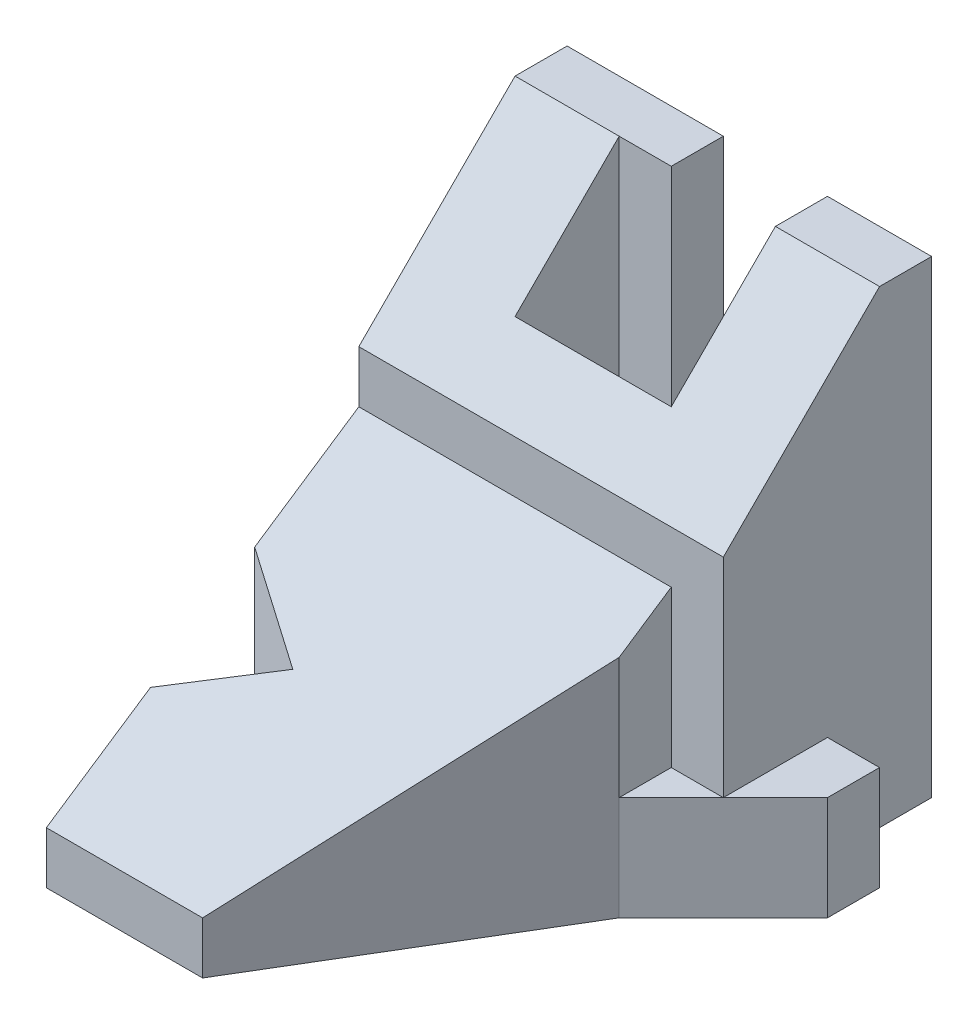
ISO-10303-21;
HEADER;
FILE_DESCRIPTION(('STEP AP214'),'2;1');
FILE_NAME('part.step','',(''),(''),'','','');
FILE_SCHEMA(('AUTOMOTIVE_DESIGN { 1 0 10303 214 1 1 1 1 }'));
ENDSEC;
DATA;
#1=APPLICATION_CONTEXT('core data for automotive mechanical design processes');
#2=APPLICATION_PROTOCOL_DEFINITION('international standard','automotive_design',2000,#1);
#3=PRODUCT_CONTEXT('',#1,'mechanical');
#4=PRODUCT('Part','Part','',(#3));
#5=PRODUCT_RELATED_PRODUCT_CATEGORY('part','',(#4));
#6=PRODUCT_DEFINITION_FORMATION('','',#4);
#7=PRODUCT_DEFINITION_CONTEXT('part definition',#1,'design');
#8=PRODUCT_DEFINITION('design','',#6,#7);
#9=PRODUCT_DEFINITION_SHAPE('','',#8);
#10=(LENGTH_UNIT() NAMED_UNIT(*) SI_UNIT(.MILLI.,.METRE.));
#11=(NAMED_UNIT(*) PLANE_ANGLE_UNIT() SI_UNIT($,.RADIAN.));
#12=(NAMED_UNIT(*) SI_UNIT($,.STERADIAN.) SOLID_ANGLE_UNIT());
#13=UNCERTAINTY_MEASURE_WITH_UNIT(LENGTH_MEASURE(1.E-05),#10,'distance_accuracy_value','');
#14=(GEOMETRIC_REPRESENTATION_CONTEXT(3) GLOBAL_UNCERTAINTY_ASSIGNED_CONTEXT((#13)) GLOBAL_UNIT_ASSIGNED_CONTEXT((#10,
#11,#12)) REPRESENTATION_CONTEXT('',''));
#15=CARTESIAN_POINT('',(0.,0.,0.));
#16=DIRECTION('',(0.,0.,1.));
#17=DIRECTION('',(1.,0.,0.));
#18=AXIS2_PLACEMENT_3D('',#15,#16,#17);
#19=CARTESIAN_POINT('',(-17.5,22.5,20.));
#20=DIRECTION('',(1.,0.,0.));
#21=DIRECTION('',(0.,1.,0.));
#22=AXIS2_PLACEMENT_3D('',#19,#20,#21);
#23=PLANE('',#22);
#24=DIRECTION('',(0.,0.554700196225229,-0.832050294337844));
#25=VECTOR('',#24,1.);
#26=CARTESIAN_POINT('',(-17.5,2.50000000000001,20.));
#27=LINE('',#26,#25);
#28=CARTESIAN_POINT('',(-17.5,-4.16666666666666,30.));
#29=VERTEX_POINT('',#28);
#30=CARTESIAN_POINT('',(-17.5,2.50000000000001,20.));
#31=VERTEX_POINT('',#30);
#32=EDGE_CURVE('E37',#29,#31,#27,.T.);
#33=ORIENTED_EDGE('',*,*,#32,.T.);
#34=DIRECTION('',(0.,-1.,0.));
#35=VECTOR('',#34,1.);
#36=CARTESIAN_POINT('',(-17.5,22.5,20.));
#37=LINE('',#36,#35);
#38=CARTESIAN_POINT('',(-17.5,7.49999999999999,20.));
#39=VERTEX_POINT('',#38);
#40=EDGE_CURVE('E264',#39,#31,#37,.T.);
#41=ORIENTED_EDGE('',*,*,#40,.F.);
#42=DIRECTION('',(0.,0.707106781186547,-0.707106781186547));
#43=VECTOR('',#42,1.);
#44=CARTESIAN_POINT('',(-17.5,22.5,5.));
#45=LINE('',#44,#43);
#46=CARTESIAN_POINT('',(-17.5,22.5,5.));
#47=VERTEX_POINT('',#46);
#48=EDGE_CURVE('E364',#39,#47,#45,.T.);
#49=ORIENTED_EDGE('',*,*,#48,.T.);
#50=DIRECTION('',(0.,0.,-1.));
#51=VECTOR('',#50,1.);
#52=CARTESIAN_POINT('',(-17.5,22.5,20.));
#53=LINE('',#52,#51);
#54=CARTESIAN_POINT('',(-17.5,22.5,0.));
#55=VERTEX_POINT('',#54);
#56=EDGE_CURVE('E411',#47,#55,#53,.T.);
#57=ORIENTED_EDGE('',*,*,#56,.T.);
#58=DIRECTION('',(0.,-1.,0.));
#59=VECTOR('',#58,1.);
#60=CARTESIAN_POINT('',(-17.5,22.5,0.));
#61=LINE('',#60,#59);
#62=CARTESIAN_POINT('',(-17.5,-22.5,0.));
#63=VERTEX_POINT('',#62);
#64=EDGE_CURVE('E327',#55,#63,#61,.T.);
#65=ORIENTED_EDGE('',*,*,#64,.T.);
#66=DIRECTION('',(0.,0.,-1.));
#67=VECTOR('',#66,1.);
#68=CARTESIAN_POINT('',(-17.5,-22.5,20.));
#69=LINE('',#68,#67);
#70=CARTESIAN_POINT('',(-17.5,-22.5,30.));
#71=VERTEX_POINT('',#70);
#72=EDGE_CURVE('E273',#71,#63,#69,.T.);
#73=ORIENTED_EDGE('',*,*,#72,.F.);
#74=DIRECTION('',(0.,1.,0.));
#75=VECTOR('',#74,1.);
#76=CARTESIAN_POINT('',(-17.5,-22.50005,30.));
#77=LINE('',#76,#75);
#78=EDGE_CURVE('E271',#71,#29,#77,.T.);
#79=ORIENTED_EDGE('',*,*,#78,.T.);
#80=EDGE_LOOP('',(#33,#41,#49,#57,#65,#73,#79));
#81=FACE_BOUND('',#80,.T.);
#82=ADVANCED_FACE('F33',(#81),#23,.F.);
#83=CARTESIAN_POINT('',(12.5,2.49999999999999,50.));
#84=DIRECTION('',(-1.,0.,0.));
#85=DIRECTION('',(0.,-1.,0.));
#86=AXIS2_PLACEMENT_3D('',#83,#84,#85);
#87=PLANE('',#86);
#88=DIRECTION('',(0.,0.554700196225229,-0.832050294337844));
#89=VECTOR('',#88,1.);
#90=CARTESIAN_POINT('',(12.5,-11.3461538461538,40.7692307692308));
#91=LINE('',#90,#89);
#92=CARTESIAN_POINT('',(12.5,-0.833333333333327,25.));
#93=VERTEX_POINT('',#92);
#94=CARTESIAN_POINT('',(12.5,2.49999999999999,20.));
#95=VERTEX_POINT('',#94);
#96=EDGE_CURVE('E266',#93,#95,#91,.T.);
#97=ORIENTED_EDGE('',*,*,#96,.F.);
#98=DIRECTION('',(0.,1.,0.));
#99=VECTOR('',#98,1.);
#100=CARTESIAN_POINT('',(12.5,-22.50005,25.));
#101=LINE('',#100,#99);
#102=CARTESIAN_POINT('',(12.5,-12.5,25.));
#103=VERTEX_POINT('',#102);
#104=EDGE_CURVE('E256',#103,#93,#101,.T.);
#105=ORIENTED_EDGE('',*,*,#104,.F.);
#106=DIRECTION('',(0.,0.,-1.));
#107=VECTOR('',#106,1.);
#108=CARTESIAN_POINT('',(12.5,-12.5,25.));
#109=LINE('',#108,#107);
#110=CARTESIAN_POINT('',(12.5,-12.5,20.));
#111=VERTEX_POINT('',#110);
#112=EDGE_CURVE('E210',#103,#111,#109,.T.);
#113=ORIENTED_EDGE('',*,*,#112,.T.);
#114=DIRECTION('',(0.,1.,0.));
#115=VECTOR('',#114,1.);
#116=CARTESIAN_POINT('',(12.5,2.49999999999999,20.));
#117=LINE('',#116,#115);
#118=EDGE_CURVE('E207',#111,#95,#117,.T.);
#119=ORIENTED_EDGE('',*,*,#118,.T.);
#120=EDGE_LOOP('',(#97,#105,#113,#119));
#121=FACE_BOUND('',#120,.T.);
#122=ADVANCED_FACE('F253',(#121),#87,.F.);
#123=CARTESIAN_POINT('',(-17.5,-17.5,50.));
#124=VERTEX_POINT('',#123);
#125=CARTESIAN_POINT('',(-17.5,-10.8333333333333,40.));
#126=VERTEX_POINT('',#125);
#127=EDGE_CURVE('E181',#124,#126,#27,.T.);
#128=ORIENTED_EDGE('',*,*,#127,.T.);
#129=DIRECTION('',(0.,1.,0.));
#130=VECTOR('',#129,1.);
#131=CARTESIAN_POINT('',(-17.5,-22.50005,40.));
#132=LINE('',#131,#130);
#133=CARTESIAN_POINT('',(-17.5,-22.5,40.));
#134=VERTEX_POINT('',#133);
#135=EDGE_CURVE('E283',#134,#126,#132,.T.);
#136=ORIENTED_EDGE('',*,*,#135,.F.);
#137=CARTESIAN_POINT('',(-17.5,-22.5,50.));
#138=VERTEX_POINT('',#137);
#139=EDGE_CURVE('E200',#138,#134,#69,.T.);
#140=ORIENTED_EDGE('',*,*,#139,.F.);
#141=DIRECTION('',(0.,-1.,0.));
#142=VECTOR('',#141,1.);
#143=CARTESIAN_POINT('',(-17.5,-22.5,50.));
#144=LINE('',#143,#142);
#145=EDGE_CURVE('E194',#124,#138,#144,.T.);
#146=ORIENTED_EDGE('',*,*,#145,.F.);
#147=EDGE_LOOP('',(#128,#136,#140,#146));
#148=FACE_BOUND('',#147,.T.);
#149=ADVANCED_FACE('F198',(#148),#23,.F.);
#150=CARTESIAN_POINT('',(0.,0.,50.));
#151=DIRECTION('',(0.,0.,-1.));
#152=DIRECTION('',(-1.,0.,0.));
#153=AXIS2_PLACEMENT_3D('',#150,#151,#152);
#154=PLANE('',#153);
#155=DIRECTION('',(-1.,0.,0.));
#156=VECTOR('',#155,1.);
#157=CARTESIAN_POINT('',(22.500025,-17.5,50.));
#158=LINE('',#157,#156);
#159=CARTESIAN_POINT('',(-2.5,-17.5,50.));
#160=VERTEX_POINT('',#159);
#161=EDGE_CURVE('E184',#160,#124,#158,.T.);
#162=ORIENTED_EDGE('',*,*,#161,.T.);
#163=ORIENTED_EDGE('',*,*,#145,.T.);
#164=DIRECTION('',(1.,0.,0.));
#165=VECTOR('',#164,1.);
#166=CARTESIAN_POINT('',(12.5,-22.5,50.));
#167=LINE('',#166,#165);
#168=CARTESIAN_POINT('',(-2.50000000000001,-22.5,50.));
#169=VERTEX_POINT('',#168);
#170=EDGE_CURVE('E202',#138,#169,#167,.T.);
#171=ORIENTED_EDGE('',*,*,#170,.T.);
#172=DIRECTION('',(0.,1.,0.));
#173=VECTOR('',#172,1.);
#174=CARTESIAN_POINT('',(-2.50000000000001,-22.50005,50.));
#175=LINE('',#174,#173);
#176=EDGE_CURVE('E196',#169,#160,#175,.T.);
#177=ORIENTED_EDGE('',*,*,#176,.T.);
#178=EDGE_LOOP('',(#162,#163,#171,#177));
#179=FACE_BOUND('',#178,.T.);
#180=ADVANCED_FACE('F192',(#179),#154,.F.);
#181=CARTESIAN_POINT('',(12.5,-22.50005,25.));
#182=DIRECTION('',(-0.857492925712544,0.,-0.514495755427527));
#183=DIRECTION('',(-0.514495755427527,0.,0.857492925712544));
#184=AXIS2_PLACEMENT_3D('',#181,#182,#183);
#185=PLANE('',#184);
#186=DIRECTION('',(0.446662500286919,0.496291666985465,-0.744437500478197));
#187=VECTOR('',#186,1.);
#188=CARTESIAN_POINT('',(7.69703325123153,-6.16996305418719,33.0049445812808));
#189=LINE('',#188,#187);
#190=EDGE_CURVE('E423',#160,#93,#189,.T.);
#191=ORIENTED_EDGE('',*,*,#190,.F.);
#192=ORIENTED_EDGE('',*,*,#176,.F.);
#193=DIRECTION('',(-0.514495755427527,0.,0.857492925712544));
#194=VECTOR('',#193,1.);
#195=CARTESIAN_POINT('',(6.76470588235294,-22.5,34.5588235294118));
#196=LINE('',#195,#194);
#197=CARTESIAN_POINT('',(12.5,-22.5,25.));
#198=VERTEX_POINT('',#197);
#199=EDGE_CURVE('E291',#198,#169,#196,.T.);
#200=ORIENTED_EDGE('',*,*,#199,.F.);
#201=DIRECTION('',(0.,-1.,0.));
#202=VECTOR('',#201,1.);
#203=CARTESIAN_POINT('',(12.5,-12.5,25.));
#204=LINE('',#203,#202);
#205=EDGE_CURVE('E225',#103,#198,#204,.T.);
#206=ORIENTED_EDGE('',*,*,#205,.F.);
#207=ORIENTED_EDGE('',*,*,#104,.T.);
#208=EDGE_LOOP('',(#191,#192,#200,#206,#207));
#209=FACE_BOUND('',#208,.T.);
#210=ADVANCED_FACE('F427',(#209),#185,.F.);
#211=CARTESIAN_POINT('',(-17.5,-22.50005,30.));
#212=DIRECTION('',(0.5,0.,-0.866025403784439));
#213=DIRECTION('',(-0.866025403784439,0.,-0.5));
#214=AXIS2_PLACEMENT_3D('',#211,#212,#213);
#215=PLANE('',#214);
#216=DIRECTION('',(0.821583836257749,-0.316227766016838,0.474341649025257));
#217=VECTOR('',#216,1.);
#218=CARTESIAN_POINT('',(-12.7368472888045,-6.000005,32.7500075));
#219=LINE('',#218,#217);
#220=CARTESIAN_POINT('',(-8.83974596215561,-7.5,35.));
#221=VERTEX_POINT('',#220);
#222=EDGE_CURVE('E49',#29,#221,#219,.T.);
#223=ORIENTED_EDGE('',*,*,#222,.F.);
#224=ORIENTED_EDGE('',*,*,#78,.F.);
#225=DIRECTION('',(-0.866025403784439,0.,-0.5));
#226=VECTOR('',#225,1.);
#227=CARTESIAN_POINT('',(-21.8301270189222,-22.5,27.5));
#228=LINE('',#227,#226);
#229=CARTESIAN_POINT('',(-8.83974596215561,-22.5,35.));
#230=VERTEX_POINT('',#229);
#231=EDGE_CURVE('E280',#230,#71,#228,.T.);
#232=ORIENTED_EDGE('',*,*,#231,.F.);
#233=DIRECTION('',(0.,1.,0.));
#234=VECTOR('',#233,1.);
#235=CARTESIAN_POINT('',(-8.83974596215561,-22.50005,35.));
#236=LINE('',#235,#234);
#237=EDGE_CURVE('E277',#230,#221,#236,.T.);
#238=ORIENTED_EDGE('',*,*,#237,.T.);
#239=EDGE_LOOP('',(#223,#224,#232,#238));
#240=FACE_BOUND('',#239,.T.);
#241=ADVANCED_FACE('F422',(#240),#215,.F.);
#242=CARTESIAN_POINT('',(-8.83974596215561,-22.50005,35.));
#243=DIRECTION('',(0.5,0.,0.866025403784438));
#244=DIRECTION('',(0.866025403784439,0.,-0.5));
#245=AXIS2_PLACEMENT_3D('',#242,#243,#244);
#246=PLANE('',#245);
#247=DIRECTION('',(-0.821583836257749,-0.316227766016838,0.474341649025257));
#248=VECTOR('',#247,1.);
#249=CARTESIAN_POINT('',(-12.7368732695666,-9.000005,37.2500075));
#250=LINE('',#249,#248);
#251=EDGE_CURVE('E11',#221,#126,#250,.T.);
#252=ORIENTED_EDGE('',*,*,#251,.F.);
#253=ORIENTED_EDGE('',*,*,#237,.F.);
#254=DIRECTION('',(0.866025403784439,0.,-0.5));
#255=VECTOR('',#254,1.);
#256=CARTESIAN_POINT('',(-8.83974596215561,-22.5,35.));
#257=LINE('',#256,#255);
#258=EDGE_CURVE('E276',#134,#230,#257,.T.);
#259=ORIENTED_EDGE('',*,*,#258,.F.);
#260=ORIENTED_EDGE('',*,*,#135,.T.);
#261=EDGE_LOOP('',(#252,#253,#259,#260));
#262=FACE_BOUND('',#261,.T.);
#263=ADVANCED_FACE('F421',(#262),#246,.F.);
#264=CARTESIAN_POINT('',(7.5,-22.5,15.));
#265=DIRECTION('',(0.,0.,1.));
#266=DIRECTION('',(1.,0.,0.));
#267=AXIS2_PLACEMENT_3D('',#264,#265,#266);
#268=PLANE('',#267);
#269=DIRECTION('',(0.,-1.,0.));
#270=VECTOR('',#269,1.);
#271=CARTESIAN_POINT('',(-7.5,-22.5,15.));
#272=LINE('',#271,#270);
#273=CARTESIAN_POINT('',(-7.5,12.5,15.));
#274=VERTEX_POINT('',#273);
#275=CARTESIAN_POINT('',(-7.5,-22.5,15.));
#276=VERTEX_POINT('',#275);
#277=EDGE_CURVE('E298',#274,#276,#272,.T.);
#278=ORIENTED_EDGE('',*,*,#277,.F.);
#279=DIRECTION('',(1.,0.,0.));
#280=VECTOR('',#279,1.);
#281=CARTESIAN_POINT('',(7.49999999999999,12.5,15.));
#282=LINE('',#281,#280);
#283=CARTESIAN_POINT('',(7.5,12.5,15.));
#284=VERTEX_POINT('',#283);
#285=EDGE_CURVE('E370',#274,#284,#282,.T.);
#286=ORIENTED_EDGE('',*,*,#285,.T.);
#287=DIRECTION('',(0.,1.,0.));
#288=VECTOR('',#287,1.);
#289=CARTESIAN_POINT('',(7.5,-22.5,15.));
#290=LINE('',#289,#288);
#291=CARTESIAN_POINT('',(7.5,-22.5,15.));
#292=VERTEX_POINT('',#291);
#293=EDGE_CURVE('E385',#292,#284,#290,.T.);
#294=ORIENTED_EDGE('',*,*,#293,.F.);
#295=DIRECTION('',(1.,0.,0.));
#296=VECTOR('',#295,1.);
#297=CARTESIAN_POINT('',(7.5,-22.5,15.));
#298=LINE('',#297,#296);
#299=EDGE_CURVE('E57',#276,#292,#298,.T.);
#300=ORIENTED_EDGE('',*,*,#299,.F.);
#301=EDGE_LOOP('',(#278,#286,#294,#300));
#302=FACE_BOUND('',#301,.T.);
#303=ADVANCED_FACE('F474',(#302),#268,.F.);
#304=CARTESIAN_POINT('',(-12.5,-22.5,5.));
#305=DIRECTION('',(0.,0.,-1.));
#306=DIRECTION('',(-1.,0.,0.));
#307=AXIS2_PLACEMENT_3D('',#304,#305,#306);
#308=PLANE('',#307);
#309=DIRECTION('',(0.,1.,0.));
#310=VECTOR('',#309,1.);
#311=CARTESIAN_POINT('',(-7.5,22.5,5.));
#312=LINE('',#311,#310);
#313=CARTESIAN_POINT('',(-7.5,-22.5,5.));
#314=VERTEX_POINT('',#313);
#315=CARTESIAN_POINT('',(-7.5,22.5,5.));
#316=VERTEX_POINT('',#315);
#317=EDGE_CURVE('E303',#314,#316,#312,.T.);
#318=ORIENTED_EDGE('',*,*,#317,.F.);
#319=DIRECTION('',(-1.,0.,0.));
#320=VECTOR('',#319,1.);
#321=CARTESIAN_POINT('',(-12.5,-22.5,5.));
#322=LINE('',#321,#320);
#323=CARTESIAN_POINT('',(-2.5,-22.5,5.));
#324=VERTEX_POINT('',#323);
#325=EDGE_CURVE('E317',#324,#314,#322,.T.);
#326=ORIENTED_EDGE('',*,*,#325,.F.);
#327=DIRECTION('',(0.,-1.,0.));
#328=VECTOR('',#327,1.);
#329=CARTESIAN_POINT('',(-2.5,-22.5,5.));
#330=LINE('',#329,#328);
#331=CARTESIAN_POINT('',(-2.5,22.5,5.));
#332=VERTEX_POINT('',#331);
#333=EDGE_CURVE('E245',#332,#324,#330,.T.);
#334=ORIENTED_EDGE('',*,*,#333,.F.);
#335=DIRECTION('',(-1.,0.,0.));
#336=VECTOR('',#335,1.);
#337=CARTESIAN_POINT('',(-12.5,22.5,5.));
#338=LINE('',#337,#336);
#339=EDGE_CURVE('E378',#332,#316,#338,.T.);
#340=ORIENTED_EDGE('',*,*,#339,.T.);
#341=EDGE_LOOP('',(#318,#326,#334,#340));
#342=FACE_BOUND('',#341,.T.);
#343=ADVANCED_FACE('F484',(#342),#308,.F.);
#344=CARTESIAN_POINT('',(0.,0.,20.));
#345=DIRECTION('',(0.,0.,1.));
#346=DIRECTION('',(1.,0.,0.));
#347=AXIS2_PLACEMENT_3D('',#344,#345,#346);
#348=PLANE('',#347);
#349=DIRECTION('',(-1.,0.,0.));
#350=VECTOR('',#349,1.);
#351=CARTESIAN_POINT('',(-17.5,2.49999999999999,20.));
#352=LINE('',#351,#350);
#353=EDGE_CURVE('E203',#95,#31,#352,.T.);
#354=ORIENTED_EDGE('',*,*,#353,.F.);
#355=ORIENTED_EDGE('',*,*,#118,.F.);
#356=DIRECTION('',(-1.,0.,0.));
#357=VECTOR('',#356,1.);
#358=CARTESIAN_POINT('',(17.5,-12.5,20.));
#359=LINE('',#358,#357);
#360=CARTESIAN_POINT('',(17.5,-12.5,20.));
#361=VERTEX_POINT('',#360);
#362=EDGE_CURVE('E223',#361,#111,#359,.T.);
#363=ORIENTED_EDGE('',*,*,#362,.F.);
#364=DIRECTION('',(0.,1.,0.));
#365=VECTOR('',#364,1.);
#366=CARTESIAN_POINT('',(17.5,22.5,20.));
#367=LINE('',#366,#365);
#368=CARTESIAN_POINT('',(17.5,7.5,20.));
#369=VERTEX_POINT('',#368);
#370=EDGE_CURVE('E322',#361,#369,#367,.T.);
#371=ORIENTED_EDGE('',*,*,#370,.T.);
#372=DIRECTION('',(1.,0.,0.));
#373=VECTOR('',#372,1.);
#374=CARTESIAN_POINT('',(-17.5,7.49999999999999,20.));
#375=LINE('',#374,#373);
#376=EDGE_CURVE('E366',#39,#369,#375,.T.);
#377=ORIENTED_EDGE('',*,*,#376,.F.);
#378=ORIENTED_EDGE('',*,*,#40,.T.);
#379=EDGE_LOOP('',(#354,#355,#363,#371,#377,#378));
#380=FACE_BOUND('',#379,.T.);
#381=ADVANCED_FACE('F260',(#380),#348,.T.);
#382=CARTESIAN_POINT('',(17.5,22.5,20.));
#383=DIRECTION('',(-1.,0.,0.));
#384=DIRECTION('',(0.,-1.,0.));
#385=AXIS2_PLACEMENT_3D('',#382,#383,#384);
#386=PLANE('',#385);
#387=DIRECTION('',(0.,0.,1.));
#388=VECTOR('',#387,1.);
#389=CARTESIAN_POINT('',(17.5,-12.5,10.));
#390=LINE('',#389,#388);
#391=CARTESIAN_POINT('',(17.5,-12.5,10.));
#392=VERTEX_POINT('',#391);
#393=EDGE_CURVE('E342',#392,#361,#390,.T.);
#394=ORIENTED_EDGE('',*,*,#393,.F.);
#395=DIRECTION('',(0.,1.,0.));
#396=VECTOR('',#395,1.);
#397=CARTESIAN_POINT('',(17.5,-22.5,10.));
#398=LINE('',#397,#396);
#399=CARTESIAN_POINT('',(17.5,-22.5,10.));
#400=VERTEX_POINT('',#399);
#401=EDGE_CURVE('E339',#400,#392,#398,.T.);
#402=ORIENTED_EDGE('',*,*,#401,.F.);
#403=DIRECTION('',(0.,0.,-1.));
#404=VECTOR('',#403,1.);
#405=CARTESIAN_POINT('',(17.5,-22.5,20.));
#406=LINE('',#405,#404);
#407=CARTESIAN_POINT('',(17.5,-22.5,0.));
#408=VERTEX_POINT('',#407);
#409=EDGE_CURVE('E335',#400,#408,#406,.T.);
#410=ORIENTED_EDGE('',*,*,#409,.T.);
#411=DIRECTION('',(0.,1.,0.));
#412=VECTOR('',#411,1.);
#413=CARTESIAN_POINT('',(17.5,22.5,0.));
#414=LINE('',#413,#412);
#415=CARTESIAN_POINT('',(17.5,22.5,0.));
#416=VERTEX_POINT('',#415);
#417=EDGE_CURVE('E391',#408,#416,#414,.T.);
#418=ORIENTED_EDGE('',*,*,#417,.T.);
#419=DIRECTION('',(0.,0.,-1.));
#420=VECTOR('',#419,1.);
#421=CARTESIAN_POINT('',(17.5,22.5,20.));
#422=LINE('',#421,#420);
#423=CARTESIAN_POINT('',(17.5,22.5,5.));
#424=VERTEX_POINT('',#423);
#425=EDGE_CURVE('E410',#424,#416,#422,.T.);
#426=ORIENTED_EDGE('',*,*,#425,.F.);
#427=DIRECTION('',(0.,0.707106781186547,-0.707106781186547));
#428=VECTOR('',#427,1.);
#429=CARTESIAN_POINT('',(17.5,22.5,5.));
#430=LINE('',#429,#428);
#431=EDGE_CURVE('E348',#369,#424,#430,.T.);
#432=ORIENTED_EDGE('',*,*,#431,.F.);
#433=ORIENTED_EDGE('',*,*,#370,.F.);
#434=EDGE_LOOP('',(#394,#402,#410,#418,#426,#432,#433));
#435=FACE_BOUND('',#434,.T.);
#436=ADVANCED_FACE('F35',(#435),#386,.F.);
#437=CARTESIAN_POINT('',(-17.5,22.5,20.));
#438=DIRECTION('',(0.,-1.,0.));
#439=DIRECTION('',(0.,0.,-1.));
#440=AXIS2_PLACEMENT_3D('',#437,#438,#439);
#441=PLANE('',#440);
#442=ORIENTED_EDGE('',*,*,#56,.F.);
#443=DIRECTION('',(1.,0.,0.));
#444=VECTOR('',#443,1.);
#445=CARTESIAN_POINT('',(-17.5,22.5,5.));
#446=LINE('',#445,#444);
#447=EDGE_CURVE('E368',#47,#316,#446,.T.);
#448=ORIENTED_EDGE('',*,*,#447,.T.);
#449=ORIENTED_EDGE('',*,*,#339,.F.);
#450=DIRECTION('',(0.,0.,1.));
#451=VECTOR('',#450,1.);
#452=CARTESIAN_POINT('',(-2.5,22.5,5.));
#453=LINE('',#452,#451);
#454=CARTESIAN_POINT('',(-2.5,22.5,0.));
#455=VERTEX_POINT('',#454);
#456=EDGE_CURVE('E306',#455,#332,#453,.T.);
#457=ORIENTED_EDGE('',*,*,#456,.F.);
#458=DIRECTION('',(-1.,0.,0.));
#459=VECTOR('',#458,1.);
#460=CARTESIAN_POINT('',(-17.5,22.5,0.));
#461=LINE('',#460,#459);
#462=EDGE_CURVE('E689',#455,#55,#461,.T.);
#463=ORIENTED_EDGE('',*,*,#462,.T.);
#464=EDGE_LOOP('',(#442,#448,#449,#457,#463));
#465=FACE_BOUND('',#464,.T.);
#466=ADVANCED_FACE('F496',(#465),#441,.F.);
#467=CARTESIAN_POINT('',(0.,0.,0.));
#468=DIRECTION('',(0.,0.,1.));
#469=DIRECTION('',(1.,0.,0.));
#470=AXIS2_PLACEMENT_3D('',#467,#468,#469);
#471=PLANE('',#470);
#472=DIRECTION('',(1.,0.,0.));
#473=VECTOR('',#472,1.);
#474=CARTESIAN_POINT('',(-17.5,-22.5,0.));
#475=LINE('',#474,#473);
#476=CARTESIAN_POINT('',(7.5,-22.5,0.));
#477=VERTEX_POINT('',#476);
#478=EDGE_CURVE('E323',#477,#408,#475,.T.);
#479=ORIENTED_EDGE('',*,*,#478,.F.);
#480=DIRECTION('',(0.,1.,0.));
#481=VECTOR('',#480,1.);
#482=CARTESIAN_POINT('',(7.5,-22.5,0.));
#483=LINE('',#482,#481);
#484=CARTESIAN_POINT('',(7.5,22.5,0.));
#485=VERTEX_POINT('',#484);
#486=EDGE_CURVE('E388',#477,#485,#483,.T.);
#487=ORIENTED_EDGE('',*,*,#486,.T.);
#488=EDGE_CURVE('E688',#416,#485,#461,.T.);
#489=ORIENTED_EDGE('',*,*,#488,.F.);
#490=ORIENTED_EDGE('',*,*,#417,.F.);
#491=EDGE_LOOP('',(#479,#487,#489,#490));
#492=FACE_BOUND('',#491,.T.);
#493=ADVANCED_FACE('F585',(#492),#471,.F.);
#494=DIRECTION('',(0.,0.,-1.));
#495=VECTOR('',#494,1.);
#496=CARTESIAN_POINT('',(7.5,22.5,0.));
#497=LINE('',#496,#495);
#498=CARTESIAN_POINT('',(7.5,22.5,5.));
#499=VERTEX_POINT('',#498);
#500=EDGE_CURVE('E380',#499,#485,#497,.T.);
#501=ORIENTED_EDGE('',*,*,#500,.F.);
#502=EDGE_CURVE('E371',#499,#424,#446,.T.);
#503=ORIENTED_EDGE('',*,*,#502,.T.);
#504=ORIENTED_EDGE('',*,*,#425,.T.);
#505=ORIENTED_EDGE('',*,*,#488,.T.);
#506=EDGE_LOOP('',(#501,#503,#504,#505));
#507=FACE_BOUND('',#506,.T.);
#508=ADVANCED_FACE('F590',(#507),#441,.F.);
#509=CARTESIAN_POINT('',(-17.5,-22.5,20.));
#510=DIRECTION('',(0.,1.,0.));
#511=DIRECTION('',(0.,0.,1.));
#512=AXIS2_PLACEMENT_3D('',#509,#510,#511);
#513=PLANE('',#512);
#514=ORIENTED_EDGE('',*,*,#258,.T.);
#515=ORIENTED_EDGE('',*,*,#231,.T.);
#516=ORIENTED_EDGE('',*,*,#72,.T.);
#517=CARTESIAN_POINT('',(-2.5,-22.5,0.));
#518=VERTEX_POINT('',#517);
#519=EDGE_CURVE('E319',#63,#518,#475,.T.);
#520=ORIENTED_EDGE('',*,*,#519,.T.);
#521=DIRECTION('',(0.,0.,-1.));
#522=VECTOR('',#521,1.);
#523=CARTESIAN_POINT('',(-2.5,-22.5,0.));
#524=LINE('',#523,#522);
#525=EDGE_CURVE('E238',#324,#518,#524,.T.);
#526=ORIENTED_EDGE('',*,*,#525,.F.);
#527=ORIENTED_EDGE('',*,*,#325,.T.);
#528=DIRECTION('',(0.,0.,-1.));
#529=VECTOR('',#528,1.);
#530=CARTESIAN_POINT('',(-7.5,-22.5,5.));
#531=LINE('',#530,#529);
#532=EDGE_CURVE('E300',#276,#314,#531,.T.);
#533=ORIENTED_EDGE('',*,*,#532,.F.);
#534=ORIENTED_EDGE('',*,*,#299,.T.);
#535=DIRECTION('',(0.,0.,-1.));
#536=VECTOR('',#535,1.);
#537=CARTESIAN_POINT('',(7.5,-22.5,0.));
#538=LINE('',#537,#536);
#539=EDGE_CURVE('E382',#292,#477,#538,.T.);
#540=ORIENTED_EDGE('',*,*,#539,.T.);
#541=ORIENTED_EDGE('',*,*,#478,.T.);
#542=ORIENTED_EDGE('',*,*,#409,.F.);
#543=DIRECTION('',(-1.,0.,0.));
#544=VECTOR('',#543,1.);
#545=CARTESIAN_POINT('',(22.5,-22.5,10.));
#546=LINE('',#545,#544);
#547=CARTESIAN_POINT('',(22.5,-22.5,10.));
#548=VERTEX_POINT('',#547);
#549=EDGE_CURVE('E345',#548,#400,#546,.T.);
#550=ORIENTED_EDGE('',*,*,#549,.F.);
#551=DIRECTION('',(0.,0.,-1.));
#552=VECTOR('',#551,1.);
#553=CARTESIAN_POINT('',(22.5,-22.5,20.));
#554=LINE('',#553,#552);
#555=CARTESIAN_POINT('',(22.5,-22.5,15.));
#556=VERTEX_POINT('',#555);
#557=EDGE_CURVE('E355',#556,#548,#554,.T.);
#558=ORIENTED_EDGE('',*,*,#557,.F.);
#559=DIRECTION('',(-0.707106781186548,0.,0.707106781186548));
#560=VECTOR('',#559,1.);
#561=CARTESIAN_POINT('',(0.,-22.5,37.5));
#562=LINE('',#561,#560);
#563=EDGE_CURVE('E215',#556,#198,#562,.T.);
#564=ORIENTED_EDGE('',*,*,#563,.T.);
#565=ORIENTED_EDGE('',*,*,#199,.T.);
#566=ORIENTED_EDGE('',*,*,#170,.F.);
#567=ORIENTED_EDGE('',*,*,#139,.T.);
#568=EDGE_LOOP('',(#514,#515,#516,#520,#526,#527,#533,#534,#540,#541,#542,#550,#558,#564,#565,
#566,#567));
#569=FACE_BOUND('',#568,.T.);
#570=ADVANCED_FACE('F315',(#569),#513,.F.);
#571=ORIENTED_EDGE('',*,*,#462,.F.);
#572=DIRECTION('',(0.,1.,0.));
#573=VECTOR('',#572,1.);
#574=CARTESIAN_POINT('',(-2.5,22.5,0.));
#575=LINE('',#574,#573);
#576=EDGE_CURVE('E231',#518,#455,#575,.T.);
#577=ORIENTED_EDGE('',*,*,#576,.F.);
#578=ORIENTED_EDGE('',*,*,#519,.F.);
#579=ORIENTED_EDGE('',*,*,#64,.F.);
#580=EDGE_LOOP('',(#571,#577,#578,#579));
#581=FACE_BOUND('',#580,.T.);
#582=ADVANCED_FACE('F576',(#581),#471,.F.);
#583=CARTESIAN_POINT('',(7.5,-22.5,0.));
#584=DIRECTION('',(1.,0.,0.));
#585=DIRECTION('',(0.,0.,-1.));
#586=AXIS2_PLACEMENT_3D('',#583,#584,#585);
#587=PLANE('',#586);
#588=ORIENTED_EDGE('',*,*,#293,.T.);
#589=DIRECTION('',(0.,0.707106781186547,-0.707106781186547));
#590=VECTOR('',#589,1.);
#591=CARTESIAN_POINT('',(7.5,2.5,25.));
#592=LINE('',#591,#590);
#593=EDGE_CURVE('E375',#284,#499,#592,.T.);
#594=ORIENTED_EDGE('',*,*,#593,.T.);
#595=ORIENTED_EDGE('',*,*,#500,.T.);
#596=ORIENTED_EDGE('',*,*,#486,.F.);
#597=ORIENTED_EDGE('',*,*,#539,.F.);
#598=EDGE_LOOP('',(#588,#594,#595,#596,#597));
#599=FACE_BOUND('',#598,.T.);
#600=ADVANCED_FACE('F568',(#599),#587,.F.);
#601=CARTESIAN_POINT('',(-17.5,22.5,5.));
#602=DIRECTION('',(0.,-0.707106781186547,-0.707106781186547));
#603=DIRECTION('',(0.,0.707106781186548,-0.707106781186548));
#604=AXIS2_PLACEMENT_3D('',#601,#602,#603);
#605=PLANE('',#604);
#606=ORIENTED_EDGE('',*,*,#285,.F.);
#607=DIRECTION('',(0.,-0.707106781186548,0.707106781186547));
#608=VECTOR('',#607,1.);
#609=CARTESIAN_POINT('',(-7.5,12.5,15.));
#610=LINE('',#609,#608);
#611=EDGE_CURVE('E295',#316,#274,#610,.T.);
#612=ORIENTED_EDGE('',*,*,#611,.F.);
#613=ORIENTED_EDGE('',*,*,#447,.F.);
#614=ORIENTED_EDGE('',*,*,#48,.F.);
#615=ORIENTED_EDGE('',*,*,#376,.T.);
#616=ORIENTED_EDGE('',*,*,#431,.T.);
#617=ORIENTED_EDGE('',*,*,#502,.F.);
#618=ORIENTED_EDGE('',*,*,#593,.F.);
#619=EDGE_LOOP('',(#606,#612,#613,#614,#615,#616,#617,#618));
#620=FACE_BOUND('',#619,.T.);
#621=ADVANCED_FACE('F560',(#620),#605,.F.);
#622=CARTESIAN_POINT('',(22.5,-22.5,10.));
#623=DIRECTION('',(0.,0.,1.));
#624=DIRECTION('',(1.,0.,0.));
#625=AXIS2_PLACEMENT_3D('',#622,#623,#624);
#626=PLANE('',#625);
#627=ORIENTED_EDGE('',*,*,#401,.T.);
#628=DIRECTION('',(-1.,0.,0.));
#629=VECTOR('',#628,1.);
#630=CARTESIAN_POINT('',(22.5,-12.5,10.));
#631=LINE('',#630,#629);
#632=CARTESIAN_POINT('',(22.5,-12.5,10.));
#633=VERTEX_POINT('',#632);
#634=EDGE_CURVE('E349',#633,#392,#631,.T.);
#635=ORIENTED_EDGE('',*,*,#634,.F.);
#636=DIRECTION('',(0.,1.,0.));
#637=VECTOR('',#636,1.);
#638=CARTESIAN_POINT('',(22.5,-22.5,10.));
#639=LINE('',#638,#637);
#640=EDGE_CURVE('E682',#548,#633,#639,.T.);
#641=ORIENTED_EDGE('',*,*,#640,.F.);
#642=ORIENTED_EDGE('',*,*,#549,.T.);
#643=EDGE_LOOP('',(#627,#635,#641,#642));
#644=FACE_BOUND('',#643,.T.);
#645=ADVANCED_FACE('F553',(#644),#626,.F.);
#646=CARTESIAN_POINT('',(22.5,-12.5,10.));
#647=DIRECTION('',(0.,-1.,0.));
#648=DIRECTION('',(1.,0.,0.));
#649=AXIS2_PLACEMENT_3D('',#646,#647,#648);
#650=PLANE('',#649);
#651=ORIENTED_EDGE('',*,*,#393,.T.);
#652=DIRECTION('',(-0.707106781186548,0.,0.707106781186548));
#653=VECTOR('',#652,1.);
#654=CARTESIAN_POINT('',(17.5,-12.5,20.));
#655=LINE('',#654,#653);
#656=CARTESIAN_POINT('',(22.5,-12.5,15.));
#657=VERTEX_POINT('',#656);
#658=EDGE_CURVE('E205',#657,#361,#655,.T.);
#659=ORIENTED_EDGE('',*,*,#658,.F.);
#660=DIRECTION('',(0.,0.,1.));
#661=VECTOR('',#660,1.);
#662=CARTESIAN_POINT('',(22.5,-12.5,10.));
#663=LINE('',#662,#661);
#664=EDGE_CURVE('E360',#633,#657,#663,.T.);
#665=ORIENTED_EDGE('',*,*,#664,.F.);
#666=ORIENTED_EDGE('',*,*,#634,.T.);
#667=EDGE_LOOP('',(#651,#659,#665,#666));
#668=FACE_BOUND('',#667,.T.);
#669=ADVANCED_FACE('F545',(#668),#650,.F.);
#670=CARTESIAN_POINT('',(22.5,0.,0.));
#671=DIRECTION('',(1.,0.,0.));
#672=DIRECTION('',(0.,0.,-1.));
#673=AXIS2_PLACEMENT_3D('',#670,#671,#672);
#674=PLANE('',#673);
#675=DIRECTION('',(0.,1.,0.));
#676=VECTOR('',#675,1.);
#677=CARTESIAN_POINT('',(22.5,0.,15.));
#678=LINE('',#677,#676);
#679=EDGE_CURVE('E43',#556,#657,#678,.T.);
#680=ORIENTED_EDGE('',*,*,#679,.F.);
#681=ORIENTED_EDGE('',*,*,#557,.T.);
#682=ORIENTED_EDGE('',*,*,#640,.T.);
#683=ORIENTED_EDGE('',*,*,#664,.T.);
#684=EDGE_LOOP('',(#680,#681,#682,#683));
#685=FACE_BOUND('',#684,.T.);
#686=ADVANCED_FACE('F408',(#685),#674,.T.);
#687=CARTESIAN_POINT('',(17.5,-22.50005,20.));
#688=DIRECTION('',(-0.707106781186548,0.,-0.707106781186548));
#689=DIRECTION('',(-0.707106781186548,0.,0.707106781186548));
#690=AXIS2_PLACEMENT_3D('',#687,#688,#689);
#691=PLANE('',#690);
#692=ORIENTED_EDGE('',*,*,#679,.T.);
#693=ORIENTED_EDGE('',*,*,#658,.T.);
#694=DIRECTION('',(-0.707106781186547,0.,0.707106781186548));
#695=VECTOR('',#694,1.);
#696=CARTESIAN_POINT('',(17.5,-12.5,20.));
#697=LINE('',#696,#695);
#698=EDGE_CURVE('E226',#361,#103,#697,.T.);
#699=ORIENTED_EDGE('',*,*,#698,.T.);
#700=ORIENTED_EDGE('',*,*,#205,.T.);
#701=ORIENTED_EDGE('',*,*,#563,.F.);
#702=EDGE_LOOP('',(#692,#693,#699,#700,#701));
#703=FACE_BOUND('',#702,.T.);
#704=ADVANCED_FACE('F405',(#703),#691,.F.);
#705=CARTESIAN_POINT('',(17.5,-12.5,25.));
#706=DIRECTION('',(0.,-1.,0.));
#707=DIRECTION('',(0.,0.,-1.));
#708=AXIS2_PLACEMENT_3D('',#705,#706,#707);
#709=PLANE('',#708);
#710=ORIENTED_EDGE('',*,*,#112,.F.);
#711=ORIENTED_EDGE('',*,*,#698,.F.);
#712=ORIENTED_EDGE('',*,*,#362,.T.);
#713=EDGE_LOOP('',(#710,#711,#712));
#714=FACE_BOUND('',#713,.T.);
#715=ADVANCED_FACE('F524',(#714),#709,.F.);
#716=CARTESIAN_POINT('',(-2.5,0.,0.));
#717=DIRECTION('',(-1.,0.,0.));
#718=DIRECTION('',(0.,0.,1.));
#719=AXIS2_PLACEMENT_3D('',#716,#717,#718);
#720=PLANE('',#719);
#721=ORIENTED_EDGE('',*,*,#456,.T.);
#722=ORIENTED_EDGE('',*,*,#333,.T.);
#723=ORIENTED_EDGE('',*,*,#525,.T.);
#724=ORIENTED_EDGE('',*,*,#576,.T.);
#725=EDGE_LOOP('',(#721,#722,#723,#724));
#726=FACE_BOUND('',#725,.T.);
#727=ADVANCED_FACE('F310',(#726),#720,.F.);
#728=CARTESIAN_POINT('',(-7.5,0.,0.));
#729=DIRECTION('',(-1.,0.,0.));
#730=DIRECTION('',(0.,0.,1.));
#731=AXIS2_PLACEMENT_3D('',#728,#729,#730);
#732=PLANE('',#731);
#733=ORIENTED_EDGE('',*,*,#611,.T.);
#734=ORIENTED_EDGE('',*,*,#277,.T.);
#735=ORIENTED_EDGE('',*,*,#532,.T.);
#736=ORIENTED_EDGE('',*,*,#317,.T.);
#737=EDGE_LOOP('',(#733,#734,#735,#736));
#738=FACE_BOUND('',#737,.T.);
#739=ADVANCED_FACE('F507',(#738),#732,.F.);
#740=CARTESIAN_POINT('',(22.500025,2.50000000000001,20.));
#741=DIRECTION('',(0.,0.832050294337844,0.554700196225229));
#742=DIRECTION('',(0.,-0.554700196225229,0.832050294337844));
#743=AXIS2_PLACEMENT_3D('',#740,#741,#742);
#744=PLANE('',#743);
#745=ORIENTED_EDGE('',*,*,#96,.T.);
#746=ORIENTED_EDGE('',*,*,#353,.T.);
#747=ORIENTED_EDGE('',*,*,#32,.F.);
#748=ORIENTED_EDGE('',*,*,#222,.T.);
#749=ORIENTED_EDGE('',*,*,#251,.T.);
#750=ORIENTED_EDGE('',*,*,#127,.F.);
#751=ORIENTED_EDGE('',*,*,#161,.F.);
#752=ORIENTED_EDGE('',*,*,#190,.T.);
#753=EDGE_LOOP('',(#745,#746,#747,#748,#749,#750,#751,#752));
#754=FACE_BOUND('',#753,.T.);
#755=ADVANCED_FACE('F183',(#754),#744,.T.);
#756=CLOSED_SHELL('',(#82,#122,#149,#180,#210,#241,#263,#303,#343,#381,#436,#466,#493,#508,#570,
#582,#600,#621,#645,#669,#686,#704,#715,#727,#739,#755));
#757=MANIFOLD_SOLID_BREP('B2',#756);
#758=ADVANCED_BREP_SHAPE_REPRESENTATION('',(#18,#757),#14);
#759=SHAPE_DEFINITION_REPRESENTATION(#9,#758);
ENDSEC;
END-ISO-10303-21;
